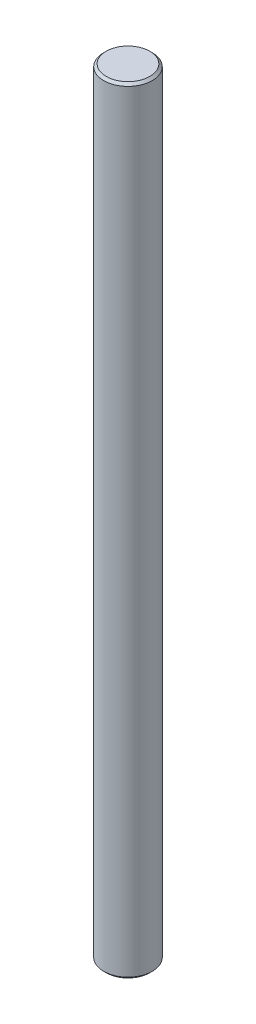
ISO-10303-21;
HEADER;
FILE_DESCRIPTION(('STEP AP214'),'2;1');
FILE_NAME('part.step','',(''),(''),'','','');
FILE_SCHEMA(('AUTOMOTIVE_DESIGN { 1 0 10303 214 1 1 1 1 }'));
ENDSEC;
DATA;
#1=APPLICATION_CONTEXT('core data for automotive mechanical design processes');
#2=APPLICATION_PROTOCOL_DEFINITION('international standard','automotive_design',2000,#1);
#3=PRODUCT_CONTEXT('',#1,'mechanical');
#4=PRODUCT('Part','Part','',(#3));
#5=PRODUCT_RELATED_PRODUCT_CATEGORY('part','',(#4));
#6=PRODUCT_DEFINITION_FORMATION('','',#4);
#7=PRODUCT_DEFINITION_CONTEXT('part definition',#1,'design');
#8=PRODUCT_DEFINITION('design','',#6,#7);
#9=PRODUCT_DEFINITION_SHAPE('','',#8);
#10=(LENGTH_UNIT() NAMED_UNIT(*) SI_UNIT(.MILLI.,.METRE.));
#11=(NAMED_UNIT(*) PLANE_ANGLE_UNIT() SI_UNIT($,.RADIAN.));
#12=(NAMED_UNIT(*) SI_UNIT($,.STERADIAN.) SOLID_ANGLE_UNIT());
#13=UNCERTAINTY_MEASURE_WITH_UNIT(LENGTH_MEASURE(1.E-05),#10,'distance_accuracy_value','');
#14=(GEOMETRIC_REPRESENTATION_CONTEXT(3) GLOBAL_UNCERTAINTY_ASSIGNED_CONTEXT((#13)) GLOBAL_UNIT_ASSIGNED_CONTEXT((#10,
#11,#12)) REPRESENTATION_CONTEXT('',''));
#15=CARTESIAN_POINT('',(0.,0.,0.));
#16=DIRECTION('',(0.,0.,1.));
#17=DIRECTION('',(1.,0.,0.));
#18=AXIS2_PLACEMENT_3D('',#15,#16,#17);
#19=CARTESIAN_POINT('',(0.,160.,0.));
#20=DIRECTION('',(0.,-1.,0.));
#21=DIRECTION('',(0.,0.,-1.));
#22=AXIS2_PLACEMENT_3D('',#19,#20,#21);
#23=CYLINDRICAL_SURFACE('',#22,5.);
#24=CARTESIAN_POINT('',(0.,0.5,0.));
#25=DIRECTION('',(0.,1.,0.));
#26=DIRECTION('',(0.,0.,1.));
#27=AXIS2_PLACEMENT_3D('',#24,#25,#26);
#28=CIRCLE('',#27,5.);
#29=CARTESIAN_POINT('',(0.,0.5,5.));
#30=VERTEX_POINT('',#29);
#31=EDGE_CURVE('E53',#30,#30,#28,.T.);
#32=ORIENTED_EDGE('',*,*,#31,.T.);
#33=EDGE_LOOP('',(#32));
#34=FACE_BOUND('',#33,.T.);
#35=CARTESIAN_POINT('',(0.,159.5,0.));
#36=DIRECTION('',(0.,1.,0.));
#37=DIRECTION('',(0.,0.,1.));
#38=AXIS2_PLACEMENT_3D('',#35,#36,#37);
#39=CIRCLE('',#38,5.);
#40=CARTESIAN_POINT('',(0.,159.5,5.));
#41=VERTEX_POINT('',#40);
#42=EDGE_CURVE('E58',#41,#41,#39,.F.);
#43=ORIENTED_EDGE('',*,*,#42,.T.);
#44=EDGE_LOOP('',(#43));
#45=FACE_BOUND('',#44,.T.);
#46=ADVANCED_FACE('F39',(#34,#45),#23,.T.);
#47=CARTESIAN_POINT('',(0.,160.,0.));
#48=DIRECTION('',(0.,1.,0.));
#49=DIRECTION('',(0.,0.,1.));
#50=AXIS2_PLACEMENT_3D('',#47,#48,#49);
#51=PLANE('',#50);
#52=CARTESIAN_POINT('',(0.,160.,0.));
#53=DIRECTION('',(0.,1.,0.));
#54=DIRECTION('',(0.,0.,1.));
#55=AXIS2_PLACEMENT_3D('',#52,#53,#54);
#56=CIRCLE('',#55,4.50000000000002);
#57=CARTESIAN_POINT('',(0.,160.,4.50000000000002));
#58=VERTEX_POINT('',#57);
#59=EDGE_CURVE('E10',#58,#58,#56,.T.);
#60=ORIENTED_EDGE('',*,*,#59,.T.);
#61=EDGE_LOOP('',(#60));
#62=FACE_BOUND('',#61,.T.);
#63=ADVANCED_FACE('F75',(#62),#51,.T.);
#64=CARTESIAN_POINT('',(0.,0.,0.));
#65=DIRECTION('',(0.,1.,0.));
#66=DIRECTION('',(0.,0.,1.));
#67=AXIS2_PLACEMENT_3D('',#64,#65,#66);
#68=PLANE('',#67);
#69=CARTESIAN_POINT('',(0.,0.,0.));
#70=DIRECTION('',(0.,1.,0.));
#71=DIRECTION('',(0.,0.,1.));
#72=AXIS2_PLACEMENT_3D('',#69,#70,#71);
#73=CIRCLE('',#72,4.5);
#74=CARTESIAN_POINT('',(0.,0.,4.5));
#75=VERTEX_POINT('',#74);
#76=EDGE_CURVE('E48',#75,#75,#73,.F.);
#77=ORIENTED_EDGE('',*,*,#76,.T.);
#78=EDGE_LOOP('',(#77));
#79=FACE_BOUND('',#78,.T.);
#80=ADVANCED_FACE('F72',(#79),#68,.F.);
#81=CARTESIAN_POINT('',(0.,0.5,0.));
#82=DIRECTION('',(0.,1.,0.));
#83=DIRECTION('',(0.,0.,1.));
#84=AXIS2_PLACEMENT_3D('',#81,#82,#83);
#85=CONICAL_SURFACE('',#84,5.,0.785398163397443);
#86=ORIENTED_EDGE('',*,*,#76,.F.);
#87=EDGE_LOOP('',(#86));
#88=FACE_BOUND('',#87,.T.);
#89=ORIENTED_EDGE('',*,*,#31,.F.);
#90=EDGE_LOOP('',(#89));
#91=FACE_BOUND('',#90,.T.);
#92=ADVANCED_FACE('F68',(#88,#91),#85,.T.);
#93=CARTESIAN_POINT('',(0.,160.,0.));
#94=DIRECTION('',(0.,-1.,0.));
#95=DIRECTION('',(0.,0.,-1.));
#96=AXIS2_PLACEMENT_3D('',#93,#94,#95);
#97=CONICAL_SURFACE('',#96,4.50000000000002,0.785398163397457);
#98=ORIENTED_EDGE('',*,*,#42,.F.);
#99=EDGE_LOOP('',(#98));
#100=FACE_BOUND('',#99,.T.);
#101=ORIENTED_EDGE('',*,*,#59,.F.);
#102=EDGE_LOOP('',(#101));
#103=FACE_BOUND('',#102,.T.);
#104=ADVANCED_FACE('F42',(#100,#103),#97,.T.);
#105=CLOSED_SHELL('',(#46,#63,#80,#92,#104));
#106=MANIFOLD_SOLID_BREP('B2',#105);
#107=ADVANCED_BREP_SHAPE_REPRESENTATION('',(#18,#106),#14);
#108=SHAPE_DEFINITION_REPRESENTATION(#9,#107);
ENDSEC;
END-ISO-10303-21;
